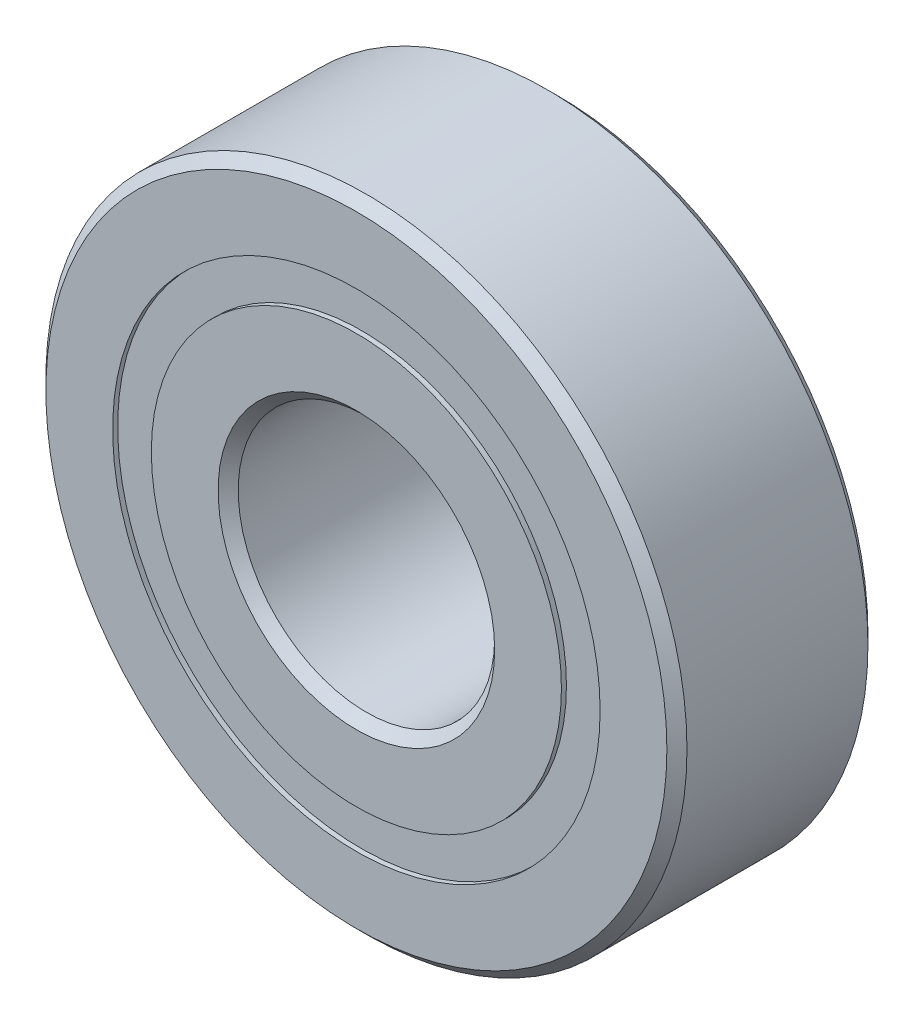
ISO-10303-21;
HEADER;
FILE_DESCRIPTION(('STEP AP214'),'2;1');
FILE_NAME('part.step','',(''),(''),'','','');
FILE_SCHEMA(('AUTOMOTIVE_DESIGN { 1 0 10303 214 1 1 1 1 }'));
ENDSEC;
DATA;
#1=APPLICATION_CONTEXT('core data for automotive mechanical design processes');
#2=APPLICATION_PROTOCOL_DEFINITION('international standard','automotive_design',2000,#1);
#3=PRODUCT_CONTEXT('',#1,'mechanical');
#4=PRODUCT('Part','Part','',(#3));
#5=PRODUCT_RELATED_PRODUCT_CATEGORY('part','',(#4));
#6=PRODUCT_DEFINITION_FORMATION('','',#4);
#7=PRODUCT_DEFINITION_CONTEXT('part definition',#1,'design');
#8=PRODUCT_DEFINITION('design','',#6,#7);
#9=PRODUCT_DEFINITION_SHAPE('','',#8);
#10=(LENGTH_UNIT() NAMED_UNIT(*) SI_UNIT(.MILLI.,.METRE.));
#11=(NAMED_UNIT(*) PLANE_ANGLE_UNIT() SI_UNIT($,.RADIAN.));
#12=(NAMED_UNIT(*) SI_UNIT($,.STERADIAN.) SOLID_ANGLE_UNIT());
#13=UNCERTAINTY_MEASURE_WITH_UNIT(LENGTH_MEASURE(1.E-05),#10,'distance_accuracy_value','');
#14=(GEOMETRIC_REPRESENTATION_CONTEXT(3) GLOBAL_UNCERTAINTY_ASSIGNED_CONTEXT((#13)) GLOBAL_UNIT_ASSIGNED_CONTEXT((#10,
#11,#12)) REPRESENTATION_CONTEXT('',''));
#15=CARTESIAN_POINT('',(0.,0.,0.));
#16=DIRECTION('',(0.,0.,1.));
#17=DIRECTION('',(1.,0.,0.));
#18=AXIS2_PLACEMENT_3D('',#15,#16,#17);
#19=CARTESIAN_POINT('',(0.,6.03522142857143,-2.36474));
#20=DIRECTION('',(0.,0.,1.));
#21=DIRECTION('',(1.,0.,0.));
#22=AXIS2_PLACEMENT_3D('',#19,#20,#21);
#23=PLANE('',#22);
#24=CARTESIAN_POINT('',(0.,0.,-2.36474));
#25=DIRECTION('',(0.,0.,1.));
#26=DIRECTION('',(1.,0.,0.));
#27=AXIS2_PLACEMENT_3D('',#24,#25,#26);
#28=CIRCLE('',#27,6.03522142857143);
#29=CARTESIAN_POINT('',(6.03522142857143,0.,-2.36474));
#30=VERTEX_POINT('',#29);
#31=EDGE_CURVE('E72',#30,#30,#28,.T.);
#32=ORIENTED_EDGE('',*,*,#31,.F.);
#33=EDGE_LOOP('',(#32));
#34=FACE_BOUND('',#33,.T.);
#35=CARTESIAN_POINT('',(0.,0.,-2.36474));
#36=DIRECTION('',(0.,0.,1.));
#37=DIRECTION('',(1.,0.,0.));
#38=AXIS2_PLACEMENT_3D('',#35,#36,#37);
#39=CIRCLE('',#38,5.07727857142857);
#40=CARTESIAN_POINT('',(5.07727857142857,0.,-2.36474));
#41=VERTEX_POINT('',#40);
#42=EDGE_CURVE('E11',#41,#41,#39,.T.);
#43=ORIENTED_EDGE('',*,*,#42,.T.);
#44=EDGE_LOOP('',(#43));
#45=FACE_BOUND('',#44,.T.);
#46=ADVANCED_FACE('F58',(#34,#45),#23,.F.);
#47=CARTESIAN_POINT('',(0.,0.,2.4892));
#48=DIRECTION('',(0.,0.,1.));
#49=DIRECTION('',(1.,0.,0.));
#50=AXIS2_PLACEMENT_3D('',#47,#48,#49);
#51=CYLINDRICAL_SURFACE('',#50,5.07727857142857);
#52=ORIENTED_EDGE('',*,*,#42,.F.);
#53=EDGE_LOOP('',(#52));
#54=FACE_BOUND('',#53,.T.);
#55=CARTESIAN_POINT('',(0.,0.,-1.20554465033679));
#56=DIRECTION('',(0.,0.,1.));
#57=DIRECTION('',(1.,0.,0.));
#58=AXIS2_PLACEMENT_3D('',#55,#56,#57);
#59=CIRCLE('',#58,5.07727857142857);
#60=CARTESIAN_POINT('',(5.07727857142857,0.,-1.20554465033679));
#61=VERTEX_POINT('',#60);
#62=EDGE_CURVE('E64',#61,#61,#59,.T.);
#63=ORIENTED_EDGE('',*,*,#62,.T.);
#64=EDGE_LOOP('',(#63));
#65=FACE_BOUND('',#64,.T.);
#66=ADVANCED_FACE('F81',(#54,#65),#51,.F.);
#67=CARTESIAN_POINT('',(0.,6.03522142857143,-1.20554465033679));
#68=DIRECTION('',(0.,0.,-1.));
#69=DIRECTION('',(-1.,0.,0.));
#70=AXIS2_PLACEMENT_3D('',#67,#68,#69);
#71=PLANE('',#70);
#72=ORIENTED_EDGE('',*,*,#62,.F.);
#73=EDGE_LOOP('',(#72));
#74=FACE_BOUND('',#73,.T.);
#75=CARTESIAN_POINT('',(0.,0.,-1.20554465033679));
#76=DIRECTION('',(0.,0.,1.));
#77=DIRECTION('',(1.,0.,0.));
#78=AXIS2_PLACEMENT_3D('',#75,#76,#77);
#79=CIRCLE('',#78,6.03522142857143);
#80=CARTESIAN_POINT('',(6.03522142857143,0.,-1.20554465033679));
#81=VERTEX_POINT('',#80);
#82=EDGE_CURVE('E68',#81,#81,#79,.T.);
#83=ORIENTED_EDGE('',*,*,#82,.T.);
#84=EDGE_LOOP('',(#83));
#85=FACE_BOUND('',#84,.T.);
#86=ADVANCED_FACE('F85',(#74,#85),#71,.F.);
#87=CARTESIAN_POINT('',(0.,0.,2.4892));
#88=DIRECTION('',(0.,0.,1.));
#89=DIRECTION('',(1.,0.,0.));
#90=AXIS2_PLACEMENT_3D('',#87,#88,#89);
#91=CYLINDRICAL_SURFACE('',#90,6.03522142857143);
#92=ORIENTED_EDGE('',*,*,#82,.F.);
#93=EDGE_LOOP('',(#92));
#94=FACE_BOUND('',#93,.T.);
#95=ORIENTED_EDGE('',*,*,#31,.T.);
#96=EDGE_LOOP('',(#95));
#97=FACE_BOUND('',#96,.T.);
#98=ADVANCED_FACE('F78',(#94,#97),#91,.T.);
#99=CLOSED_SHELL('',(#46,#66,#86,#98));
#100=MANIFOLD_SOLID_BREP('B2',#99);
#101=CARTESIAN_POINT('',(0.,6.03522142857143,2.36474));
#102=DIRECTION('',(0.,0.,-1.));
#103=DIRECTION('',(-1.,0.,0.));
#104=AXIS2_PLACEMENT_3D('',#101,#102,#103);
#105=PLANE('',#104);
#106=CARTESIAN_POINT('',(0.,0.,2.36474));
#107=DIRECTION('',(0.,0.,1.));
#108=DIRECTION('',(1.,0.,0.));
#109=AXIS2_PLACEMENT_3D('',#106,#107,#108);
#110=CIRCLE('',#109,5.07727857142857);
#111=CARTESIAN_POINT('',(5.07727857142857,0.,2.36474));
#112=VERTEX_POINT('',#111);
#113=EDGE_CURVE('E57',#112,#112,#110,.T.);
#114=ORIENTED_EDGE('',*,*,#113,.F.);
#115=EDGE_LOOP('',(#114));
#116=FACE_BOUND('',#115,.T.);
#117=CARTESIAN_POINT('',(0.,0.,2.36474));
#118=DIRECTION('',(0.,0.,1.));
#119=DIRECTION('',(1.,0.,0.));
#120=AXIS2_PLACEMENT_3D('',#117,#118,#119);
#121=CIRCLE('',#120,6.03522142857143);
#122=CARTESIAN_POINT('',(6.03522142857143,0.,2.36474));
#123=VERTEX_POINT('',#122);
#124=EDGE_CURVE('E156',#123,#123,#121,.T.);
#125=ORIENTED_EDGE('',*,*,#124,.T.);
#126=EDGE_LOOP('',(#125));
#127=FACE_BOUND('',#126,.T.);
#128=ADVANCED_FACE('F142',(#116,#127),#105,.F.);
#129=CARTESIAN_POINT('',(0.,0.,2.4892));
#130=DIRECTION('',(0.,0.,1.));
#131=DIRECTION('',(1.,0.,0.));
#132=AXIS2_PLACEMENT_3D('',#129,#130,#131);
#133=CYLINDRICAL_SURFACE('',#132,5.07727857142857);
#134=CARTESIAN_POINT('',(0.,0.,1.20554465033679));
#135=DIRECTION('',(0.,0.,1.));
#136=DIRECTION('',(1.,0.,0.));
#137=AXIS2_PLACEMENT_3D('',#134,#135,#136);
#138=CIRCLE('',#137,5.07727857142857);
#139=CARTESIAN_POINT('',(5.07727857142857,0.,1.20554465033679));
#140=VERTEX_POINT('',#139);
#141=EDGE_CURVE('E148',#140,#140,#138,.T.);
#142=ORIENTED_EDGE('',*,*,#141,.F.);
#143=EDGE_LOOP('',(#142));
#144=FACE_BOUND('',#143,.T.);
#145=ORIENTED_EDGE('',*,*,#113,.T.);
#146=EDGE_LOOP('',(#145));
#147=FACE_BOUND('',#146,.T.);
#148=ADVANCED_FACE('F171',(#144,#147),#133,.F.);
#149=CARTESIAN_POINT('',(0.,6.03522142857143,1.20554465033679));
#150=DIRECTION('',(0.,0.,1.));
#151=DIRECTION('',(1.,0.,0.));
#152=AXIS2_PLACEMENT_3D('',#149,#150,#151);
#153=PLANE('',#152);
#154=CARTESIAN_POINT('',(0.,0.,1.20554465033679));
#155=DIRECTION('',(0.,0.,1.));
#156=DIRECTION('',(1.,0.,0.));
#157=AXIS2_PLACEMENT_3D('',#154,#155,#156);
#158=CIRCLE('',#157,6.03522142857143);
#159=CARTESIAN_POINT('',(6.03522142857143,0.,1.20554465033679));
#160=VERTEX_POINT('',#159);
#161=EDGE_CURVE('E152',#160,#160,#158,.T.);
#162=ORIENTED_EDGE('',*,*,#161,.F.);
#163=EDGE_LOOP('',(#162));
#164=FACE_BOUND('',#163,.T.);
#165=ORIENTED_EDGE('',*,*,#141,.T.);
#166=EDGE_LOOP('',(#165));
#167=FACE_BOUND('',#166,.T.);
#168=ADVANCED_FACE('F166',(#164,#167),#153,.F.);
#169=CARTESIAN_POINT('',(0.,0.,2.4892));
#170=DIRECTION('',(0.,0.,1.));
#171=DIRECTION('',(1.,0.,0.));
#172=AXIS2_PLACEMENT_3D('',#169,#170,#171);
#173=CYLINDRICAL_SURFACE('',#172,6.03522142857143);
#174=ORIENTED_EDGE('',*,*,#124,.F.);
#175=EDGE_LOOP('',(#174));
#176=FACE_BOUND('',#175,.T.);
#177=ORIENTED_EDGE('',*,*,#161,.T.);
#178=EDGE_LOOP('',(#177));
#179=FACE_BOUND('',#178,.T.);
#180=ADVANCED_FACE('F163',(#176,#179),#173,.T.);
#181=CLOSED_SHELL('',(#128,#148,#168,#180));
#182=MANIFOLD_SOLID_BREP('B6',#181);
#183=CARTESIAN_POINT('',(-3.26588180805,4.49510067499584,0.));
#184=DIRECTION('',(0.,0.,1.));
#185=DIRECTION('',(-0.587785252292462,0.809016994374955,0.));
#186=AXIS2_PLACEMENT_3D('',#183,#184,#185);
#187=SPHERICAL_SURFACE('',#186,1.20554465033679);
#188=CARTESIAN_POINT('',(-3.26588180805,4.49510067499584,1.20554465033679));
#189=VERTEX_POINT('',#188);
#190=VERTEX_LOOP('',#189);
#191=FACE_BOUND('',#190,.T.);
#192=ADVANCED_FACE('F226',(#191),#187,.T.);
#193=CLOSED_SHELL('',(#192));
#194=MANIFOLD_SOLID_BREP('B52',#193);
#195=CARTESIAN_POINT('',(-5.28430776866493,1.71697567499586,0.));
#196=DIRECTION('',(0.,0.,1.));
#197=DIRECTION('',(-0.95105651629515,0.309016994374958,0.));
#198=AXIS2_PLACEMENT_3D('',#195,#196,#197);
#199=SPHERICAL_SURFACE('',#198,1.20554465033679);
#200=CARTESIAN_POINT('',(-5.28430776866493,1.71697567499586,1.20554465033679));
#201=VERTEX_POINT('',#200);
#202=VERTEX_LOOP('',#201);
#203=FACE_BOUND('',#202,.T.);
#204=ADVANCED_FACE('F249',(#203),#199,.T.);
#205=CLOSED_SHELL('',(#204));
#206=MANIFOLD_SOLID_BREP('B138',#205);
#207=CARTESIAN_POINT('',(-5.28430776866496,-1.71697567499575,0.));
#208=DIRECTION('',(0.,0.,1.));
#209=DIRECTION('',(-0.951056516295157,-0.309016994374938,0.));
#210=AXIS2_PLACEMENT_3D('',#207,#208,#209);
#211=SPHERICAL_SURFACE('',#210,1.20554465033679);
#212=CARTESIAN_POINT('',(-5.28430776866496,-1.71697567499575,1.20554465033679));
#213=VERTEX_POINT('',#212);
#214=VERTEX_LOOP('',#213);
#215=FACE_BOUND('',#214,.T.);
#216=ADVANCED_FACE('F272',(#215),#211,.T.);
#217=CLOSED_SHELL('',(#216));
#218=MANIFOLD_SOLID_BREP('B222',#217);
#219=CARTESIAN_POINT('',(-3.26588180805009,-4.49510067499577,0.));
#220=DIRECTION('',(0.,0.,1.));
#221=DIRECTION('',(-0.58778525229248,-0.809016994374942,0.));
#222=AXIS2_PLACEMENT_3D('',#219,#220,#221);
#223=SPHERICAL_SURFACE('',#222,1.20554465033679);
#224=CARTESIAN_POINT('',(-3.26588180805009,-4.49510067499577,1.20554465033679));
#225=VERTEX_POINT('',#224);
#226=VERTEX_LOOP('',#225);
#227=FACE_BOUND('',#226,.T.);
#228=ADVANCED_FACE('F295',(#227),#223,.T.);
#229=CLOSED_SHELL('',(#228));
#230=MANIFOLD_SOLID_BREP('B245',#229);
#231=CARTESIAN_POINT('',(0.,-5.55625,0.));
#232=DIRECTION('',(0.,0.,1.));
#233=DIRECTION('',(0.,-1.,0.));
#234=AXIS2_PLACEMENT_3D('',#231,#232,#233);
#235=SPHERICAL_SURFACE('',#234,1.20554465033679);
#236=CARTESIAN_POINT('',(0.,-5.55625,1.20554465033679));
#237=VERTEX_POINT('',#236);
#238=VERTEX_LOOP('',#237);
#239=FACE_BOUND('',#238,.T.);
#240=ADVANCED_FACE('F318',(#239),#235,.T.);
#241=CLOSED_SHELL('',(#240));
#242=MANIFOLD_SOLID_BREP('B268',#241);
#243=CARTESIAN_POINT('',(3.26588180805003,-4.49510067499582,0.));
#244=DIRECTION('',(0.,0.,1.));
#245=DIRECTION('',(0.587785252292469,-0.809016994374951,0.));
#246=AXIS2_PLACEMENT_3D('',#243,#244,#245);
#247=SPHERICAL_SURFACE('',#246,1.20554465033679);
#248=CARTESIAN_POINT('',(3.26588180805003,-4.49510067499582,1.20554465033679));
#249=VERTEX_POINT('',#248);
#250=VERTEX_LOOP('',#249);
#251=FACE_BOUND('',#250,.T.);
#252=ADVANCED_FACE('F341',(#251),#247,.T.);
#253=CLOSED_SHELL('',(#252));
#254=MANIFOLD_SOLID_BREP('B291',#253);
#255=CARTESIAN_POINT('',(5.28430776866494,-1.71697567499582,0.));
#256=DIRECTION('',(0.,0.,1.));
#257=DIRECTION('',(0.951056516295152,-0.309016994374952,0.));
#258=AXIS2_PLACEMENT_3D('',#255,#256,#257);
#259=SPHERICAL_SURFACE('',#258,1.20554465033679);
#260=CARTESIAN_POINT('',(5.28430776866494,-1.71697567499582,1.20554465033679));
#261=VERTEX_POINT('',#260);
#262=VERTEX_LOOP('',#261);
#263=FACE_BOUND('',#262,.T.);
#264=ADVANCED_FACE('F364',(#263),#259,.T.);
#265=CLOSED_SHELL('',(#264));
#266=MANIFOLD_SOLID_BREP('B314',#265);
#267=CARTESIAN_POINT('',(5.28430776866495,1.71697567499579,0.));
#268=DIRECTION('',(0.,0.,1.));
#269=DIRECTION('',(0.951056516295155,0.309016994374945,0.));
#270=AXIS2_PLACEMENT_3D('',#267,#268,#269);
#271=SPHERICAL_SURFACE('',#270,1.20554465033679);
#272=CARTESIAN_POINT('',(5.28430776866495,1.71697567499579,1.20554465033679));
#273=VERTEX_POINT('',#272);
#274=VERTEX_LOOP('',#273);
#275=FACE_BOUND('',#274,.T.);
#276=ADVANCED_FACE('F387',(#275),#271,.T.);
#277=CLOSED_SHELL('',(#276));
#278=MANIFOLD_SOLID_BREP('B337',#277);
#279=CARTESIAN_POINT('',(3.26588180805006,4.4951006749958,0.));
#280=DIRECTION('',(0.,0.,1.));
#281=DIRECTION('',(0.587785252292474,0.809016994374947,0.));
#282=AXIS2_PLACEMENT_3D('',#279,#280,#281);
#283=SPHERICAL_SURFACE('',#282,1.20554465033679);
#284=CARTESIAN_POINT('',(3.26588180805006,4.4951006749958,1.20554465033679));
#285=VERTEX_POINT('',#284);
#286=VERTEX_LOOP('',#285);
#287=FACE_BOUND('',#286,.T.);
#288=ADVANCED_FACE('F410',(#287),#283,.T.);
#289=CLOSED_SHELL('',(#288));
#290=MANIFOLD_SOLID_BREP('B360',#289);
#291=CARTESIAN_POINT('',(0.,5.55625,0.));
#292=DIRECTION('',(0.,0.,1.));
#293=DIRECTION('',(0.,1.,0.));
#294=AXIS2_PLACEMENT_3D('',#291,#292,#293);
#295=SPHERICAL_SURFACE('',#294,1.20554465033679);
#296=CARTESIAN_POINT('',(0.,5.55625,1.20554465033679));
#297=VERTEX_POINT('',#296);
#298=VERTEX_LOOP('',#297);
#299=FACE_BOUND('',#298,.T.);
#300=ADVANCED_FACE('F435',(#299),#295,.T.);
#301=CLOSED_SHELL('',(#300));
#302=MANIFOLD_SOLID_BREP('B383',#301);
#303=CARTESIAN_POINT('',(0.,5.07727857142857,2.4892));
#304=DIRECTION('',(0.,0.,-1.));
#305=DIRECTION('',(-1.,0.,0.));
#306=AXIS2_PLACEMENT_3D('',#303,#304,#305);
#307=PLANE('',#306);
#308=CARTESIAN_POINT('',(0.,0.,2.4892));
#309=DIRECTION('',(0.,0.,1.));
#310=DIRECTION('',(1.,0.,0.));
#311=AXIS2_PLACEMENT_3D('',#308,#309,#310);
#312=CIRCLE('',#311,3.42392);
#313=CARTESIAN_POINT('',(3.42392,0.,2.4892));
#314=VERTEX_POINT('',#313);
#315=EDGE_CURVE('E481',#314,#314,#312,.T.);
#316=ORIENTED_EDGE('',*,*,#315,.F.);
#317=EDGE_LOOP('',(#316));
#318=FACE_BOUND('',#317,.T.);
#319=CARTESIAN_POINT('',(0.,0.,2.4892));
#320=DIRECTION('',(0.,0.,1.));
#321=DIRECTION('',(1.,0.,0.));
#322=AXIS2_PLACEMENT_3D('',#319,#320,#321);
#323=CIRCLE('',#322,5.07727857142857);
#324=CARTESIAN_POINT('',(5.07727857142857,0.,2.4892));
#325=VERTEX_POINT('',#324);
#326=EDGE_CURVE('E434',#325,#325,#323,.T.);
#327=ORIENTED_EDGE('',*,*,#326,.T.);
#328=EDGE_LOOP('',(#327));
#329=FACE_BOUND('',#328,.T.);
#330=ADVANCED_FACE('F453',(#318,#329),#307,.F.);
#331=CARTESIAN_POINT('',(0.,0.,2.4892));
#332=DIRECTION('',(0.,0.,1.));
#333=DIRECTION('',(1.,0.,0.));
#334=AXIS2_PLACEMENT_3D('',#331,#332,#333);
#335=CYLINDRICAL_SURFACE('',#334,5.07727857142857);
#336=ORIENTED_EDGE('',*,*,#326,.F.);
#337=EDGE_LOOP('',(#336));
#338=FACE_BOUND('',#337,.T.);
#339=CARTESIAN_POINT('',(0.,0.,1.10631111111111));
#340=DIRECTION('',(0.,0.,1.));
#341=DIRECTION('',(1.,0.,0.));
#342=AXIS2_PLACEMENT_3D('',#339,#340,#341);
#343=CIRCLE('',#342,5.07727857142857);
#344=CARTESIAN_POINT('',(5.07727857142857,0.,1.10631111111111));
#345=VERTEX_POINT('',#344);
#346=EDGE_CURVE('E459',#345,#345,#343,.T.);
#347=ORIENTED_EDGE('',*,*,#346,.T.);
#348=EDGE_LOOP('',(#347));
#349=FACE_BOUND('',#348,.T.);
#350=ADVANCED_FACE('F488',(#338,#349),#335,.T.);
#351=CARTESIAN_POINT('',(0.,0.,0.));
#352=DIRECTION('',(0.,0.,1.));
#353=DIRECTION('',(1.,0.,0.));
#354=AXIS2_PLACEMENT_3D('',#351,#352,#353);
#355=TOROIDAL_SURFACE('',#354,5.55625,1.20554465033679);
#356=ORIENTED_EDGE('',*,*,#346,.F.);
#357=EDGE_LOOP('',(#356));
#358=FACE_BOUND('',#357,.T.);
#359=CARTESIAN_POINT('',(0.,0.,-1.10631111111111));
#360=DIRECTION('',(0.,0.,1.));
#361=DIRECTION('',(1.,0.,0.));
#362=AXIS2_PLACEMENT_3D('',#359,#360,#361);
#363=CIRCLE('',#362,5.07727857142857);
#364=CARTESIAN_POINT('',(5.07727857142857,0.,-1.10631111111111));
#365=VERTEX_POINT('',#364);
#366=EDGE_CURVE('E463',#365,#365,#363,.T.);
#367=ORIENTED_EDGE('',*,*,#366,.T.);
#368=EDGE_LOOP('',(#367));
#369=FACE_BOUND('',#368,.T.);
#370=ADVANCED_FACE('F492',(#358,#369),#355,.F.);
#371=CARTESIAN_POINT('',(0.,0.,2.4892));
#372=DIRECTION('',(0.,0.,1.));
#373=DIRECTION('',(1.,0.,0.));
#374=AXIS2_PLACEMENT_3D('',#371,#372,#373);
#375=CYLINDRICAL_SURFACE('',#374,5.07727857142857);
#376=ORIENTED_EDGE('',*,*,#366,.F.);
#377=EDGE_LOOP('',(#376));
#378=FACE_BOUND('',#377,.T.);
#379=CARTESIAN_POINT('',(0.,0.,-2.4892));
#380=DIRECTION('',(0.,0.,1.));
#381=DIRECTION('',(1.,0.,0.));
#382=AXIS2_PLACEMENT_3D('',#379,#380,#381);
#383=CIRCLE('',#382,5.07727857142857);
#384=CARTESIAN_POINT('',(5.07727857142857,0.,-2.4892));
#385=VERTEX_POINT('',#384);
#386=EDGE_CURVE('E467',#385,#385,#383,.T.);
#387=ORIENTED_EDGE('',*,*,#386,.T.);
#388=EDGE_LOOP('',(#387));
#389=FACE_BOUND('',#388,.T.);
#390=ADVANCED_FACE('F497',(#378,#389),#375,.T.);
#391=CARTESIAN_POINT('',(0.,3.42392,-2.4892));
#392=DIRECTION('',(0.,0.,1.));
#393=DIRECTION('',(1.,0.,0.));
#394=AXIS2_PLACEMENT_3D('',#391,#392,#393);
#395=PLANE('',#394);
#396=ORIENTED_EDGE('',*,*,#386,.F.);
#397=EDGE_LOOP('',(#396));
#398=FACE_BOUND('',#397,.T.);
#399=CARTESIAN_POINT('',(0.,0.,-2.4892));
#400=DIRECTION('',(0.,0.,1.));
#401=DIRECTION('',(1.,0.,0.));
#402=AXIS2_PLACEMENT_3D('',#399,#400,#401);
#403=CIRCLE('',#402,3.42392);
#404=CARTESIAN_POINT('',(3.42392,0.,-2.4892));
#405=VERTEX_POINT('',#404);
#406=EDGE_CURVE('E472',#405,#405,#403,.T.);
#407=ORIENTED_EDGE('',*,*,#406,.T.);
#408=EDGE_LOOP('',(#407));
#409=FACE_BOUND('',#408,.T.);
#410=ADVANCED_FACE('F503',(#398,#409),#395,.F.);
#411=CARTESIAN_POINT('',(0.,0.,-2.24028));
#412=DIRECTION('',(0.,0.,-1.));
#413=DIRECTION('',(-1.,0.,0.));
#414=AXIS2_PLACEMENT_3D('',#411,#412,#413);
#415=CONICAL_SURFACE('',#414,3.175,0.785398163397446);
#416=ORIENTED_EDGE('',*,*,#406,.F.);
#417=EDGE_LOOP('',(#416));
#418=FACE_BOUND('',#417,.T.);
#419=CARTESIAN_POINT('',(0.,0.,-2.24028));
#420=DIRECTION('',(0.,0.,1.));
#421=DIRECTION('',(1.,0.,0.));
#422=AXIS2_PLACEMENT_3D('',#419,#420,#421);
#423=CIRCLE('',#422,3.175);
#424=CARTESIAN_POINT('',(3.175,0.,-2.24028));
#425=VERTEX_POINT('',#424);
#426=EDGE_CURVE('E475',#425,#425,#423,.T.);
#427=ORIENTED_EDGE('',*,*,#426,.T.);
#428=EDGE_LOOP('',(#427));
#429=FACE_BOUND('',#428,.T.);
#430=ADVANCED_FACE('F507',(#418,#429),#415,.F.);
#431=CARTESIAN_POINT('',(0.,0.,2.4892));
#432=DIRECTION('',(0.,0.,1.));
#433=DIRECTION('',(1.,0.,0.));
#434=AXIS2_PLACEMENT_3D('',#431,#432,#433);
#435=CYLINDRICAL_SURFACE('',#434,3.175);
#436=ORIENTED_EDGE('',*,*,#426,.F.);
#437=EDGE_LOOP('',(#436));
#438=FACE_BOUND('',#437,.T.);
#439=CARTESIAN_POINT('',(0.,0.,2.24028));
#440=DIRECTION('',(0.,0.,1.));
#441=DIRECTION('',(1.,0.,0.));
#442=AXIS2_PLACEMENT_3D('',#439,#440,#441);
#443=CIRCLE('',#442,3.175);
#444=CARTESIAN_POINT('',(3.175,0.,2.24028));
#445=VERTEX_POINT('',#444);
#446=EDGE_CURVE('E478',#445,#445,#443,.T.);
#447=ORIENTED_EDGE('',*,*,#446,.T.);
#448=EDGE_LOOP('',(#447));
#449=FACE_BOUND('',#448,.T.);
#450=ADVANCED_FACE('F511',(#438,#449),#435,.F.);
#451=CARTESIAN_POINT('',(0.,0.,2.4892));
#452=DIRECTION('',(0.,0.,1.));
#453=DIRECTION('',(1.,0.,0.));
#454=AXIS2_PLACEMENT_3D('',#451,#452,#453);
#455=CONICAL_SURFACE('',#454,3.42392,0.785398163397449);
#456=ORIENTED_EDGE('',*,*,#446,.F.);
#457=EDGE_LOOP('',(#456));
#458=FACE_BOUND('',#457,.T.);
#459=ORIENTED_EDGE('',*,*,#315,.T.);
#460=EDGE_LOOP('',(#459));
#461=FACE_BOUND('',#460,.T.);
#462=ADVANCED_FACE('F485',(#458,#461),#455,.F.);
#463=CLOSED_SHELL('',(#330,#350,#370,#390,#410,#430,#450,#462));
#464=MANIFOLD_SOLID_BREP('B406',#463);
#465=CARTESIAN_POINT('',(0.,0.,2.24028));
#466=DIRECTION('',(0.,0.,-1.));
#467=DIRECTION('',(-1.,0.,0.));
#468=AXIS2_PLACEMENT_3D('',#465,#466,#467);
#469=CONICAL_SURFACE('',#468,7.9375,0.785398163397446);
#470=CARTESIAN_POINT('',(0.,0.,2.4892));
#471=DIRECTION('',(0.,0.,1.));
#472=DIRECTION('',(1.,0.,0.));
#473=AXIS2_PLACEMENT_3D('',#470,#471,#472);
#474=CIRCLE('',#473,7.68858);
#475=CARTESIAN_POINT('',(7.68858,0.,2.4892));
#476=VERTEX_POINT('',#475);
#477=EDGE_CURVE('E594',#476,#476,#474,.T.);
#478=ORIENTED_EDGE('',*,*,#477,.F.);
#479=EDGE_LOOP('',(#478));
#480=FACE_BOUND('',#479,.T.);
#481=CARTESIAN_POINT('',(0.,0.,2.24028));
#482=DIRECTION('',(0.,0.,1.));
#483=DIRECTION('',(1.,0.,0.));
#484=AXIS2_PLACEMENT_3D('',#481,#482,#483);
#485=CIRCLE('',#484,7.9375);
#486=CARTESIAN_POINT('',(7.9375,0.,2.24028));
#487=VERTEX_POINT('',#486);
#488=EDGE_CURVE('E452',#487,#487,#485,.T.);
#489=ORIENTED_EDGE('',*,*,#488,.T.);
#490=EDGE_LOOP('',(#489));
#491=FACE_BOUND('',#490,.T.);
#492=ADVANCED_FACE('F559',(#480,#491),#469,.T.);
#493=CARTESIAN_POINT('',(0.,0.,2.4892));
#494=DIRECTION('',(0.,0.,1.));
#495=DIRECTION('',(1.,0.,0.));
#496=AXIS2_PLACEMENT_3D('',#493,#494,#495);
#497=CYLINDRICAL_SURFACE('',#496,7.9375);
#498=ORIENTED_EDGE('',*,*,#488,.F.);
#499=EDGE_LOOP('',(#498));
#500=FACE_BOUND('',#499,.T.);
#501=CARTESIAN_POINT('',(0.,0.,-2.24028));
#502=DIRECTION('',(0.,0.,1.));
#503=DIRECTION('',(1.,0.,0.));
#504=AXIS2_PLACEMENT_3D('',#501,#502,#503);
#505=CIRCLE('',#504,7.9375);
#506=CARTESIAN_POINT('',(7.9375,0.,-2.24028));
#507=VERTEX_POINT('',#506);
#508=EDGE_CURVE('E566',#507,#507,#505,.T.);
#509=ORIENTED_EDGE('',*,*,#508,.T.);
#510=EDGE_LOOP('',(#509));
#511=FACE_BOUND('',#510,.T.);
#512=ADVANCED_FACE('F602',(#500,#511),#497,.T.);
#513=CARTESIAN_POINT('',(0.,0.,-2.4892));
#514=DIRECTION('',(0.,0.,1.));
#515=DIRECTION('',(1.,0.,0.));
#516=AXIS2_PLACEMENT_3D('',#513,#514,#515);
#517=CONICAL_SURFACE('',#516,7.68858,0.785398163397445);
#518=ORIENTED_EDGE('',*,*,#508,.F.);
#519=EDGE_LOOP('',(#518));
#520=FACE_BOUND('',#519,.T.);
#521=CARTESIAN_POINT('',(0.,0.,-2.4892));
#522=DIRECTION('',(0.,0.,1.));
#523=DIRECTION('',(1.,0.,0.));
#524=AXIS2_PLACEMENT_3D('',#521,#522,#523);
#525=CIRCLE('',#524,7.68858);
#526=CARTESIAN_POINT('',(7.68858,0.,-2.4892));
#527=VERTEX_POINT('',#526);
#528=EDGE_CURVE('E571',#527,#527,#525,.T.);
#529=ORIENTED_EDGE('',*,*,#528,.T.);
#530=EDGE_LOOP('',(#529));
#531=FACE_BOUND('',#530,.T.);
#532=ADVANCED_FACE('F606',(#520,#531),#517,.T.);
#533=CARTESIAN_POINT('',(0.,7.68858,-2.4892));
#534=DIRECTION('',(0.,0.,1.));
#535=DIRECTION('',(1.,0.,0.));
#536=AXIS2_PLACEMENT_3D('',#533,#534,#535);
#537=PLANE('',#536);
#538=ORIENTED_EDGE('',*,*,#528,.F.);
#539=EDGE_LOOP('',(#538));
#540=FACE_BOUND('',#539,.T.);
#541=CARTESIAN_POINT('',(0.,0.,-2.4892));
#542=DIRECTION('',(0.,0.,1.));
#543=DIRECTION('',(1.,0.,0.));
#544=AXIS2_PLACEMENT_3D('',#541,#542,#543);
#545=CIRCLE('',#544,6.03522142857143);
#546=CARTESIAN_POINT('',(6.03522142857143,0.,-2.4892));
#547=VERTEX_POINT('',#546);
#548=EDGE_CURVE('E576',#547,#547,#545,.T.);
#549=ORIENTED_EDGE('',*,*,#548,.T.);
#550=EDGE_LOOP('',(#549));
#551=FACE_BOUND('',#550,.T.);
#552=ADVANCED_FACE('F611',(#540,#551),#537,.F.);
#553=CARTESIAN_POINT('',(0.,0.,2.4892));
#554=DIRECTION('',(0.,0.,1.));
#555=DIRECTION('',(1.,0.,0.));
#556=AXIS2_PLACEMENT_3D('',#553,#554,#555);
#557=CYLINDRICAL_SURFACE('',#556,6.03522142857143);
#558=ORIENTED_EDGE('',*,*,#548,.F.);
#559=EDGE_LOOP('',(#558));
#560=FACE_BOUND('',#559,.T.);
#561=CARTESIAN_POINT('',(0.,0.,-1.10631111111111));
#562=DIRECTION('',(0.,0.,1.));
#563=DIRECTION('',(1.,0.,0.));
#564=AXIS2_PLACEMENT_3D('',#561,#562,#563);
#565=CIRCLE('',#564,6.03522142857143);
#566=CARTESIAN_POINT('',(6.03522142857143,0.,-1.10631111111111));
#567=VERTEX_POINT('',#566);
#568=EDGE_CURVE('E582',#567,#567,#565,.T.);
#569=ORIENTED_EDGE('',*,*,#568,.T.);
#570=EDGE_LOOP('',(#569));
#571=FACE_BOUND('',#570,.T.);
#572=ADVANCED_FACE('F617',(#560,#571),#557,.F.);
#573=CARTESIAN_POINT('',(0.,0.,0.));
#574=DIRECTION('',(0.,0.,1.));
#575=DIRECTION('',(1.,0.,0.));
#576=AXIS2_PLACEMENT_3D('',#573,#574,#575);
#577=TOROIDAL_SURFACE('',#576,5.55625,1.20554465033679);
#578=ORIENTED_EDGE('',*,*,#568,.F.);
#579=EDGE_LOOP('',(#578));
#580=FACE_BOUND('',#579,.T.);
#581=CARTESIAN_POINT('',(0.,0.,1.10631111111111));
#582=DIRECTION('',(0.,0.,1.));
#583=DIRECTION('',(1.,0.,0.));
#584=AXIS2_PLACEMENT_3D('',#581,#582,#583);
#585=CIRCLE('',#584,6.03522142857143);
#586=CARTESIAN_POINT('',(6.03522142857143,0.,1.10631111111111));
#587=VERTEX_POINT('',#586);
#588=EDGE_CURVE('E586',#587,#587,#585,.T.);
#589=ORIENTED_EDGE('',*,*,#588,.T.);
#590=EDGE_LOOP('',(#589));
#591=FACE_BOUND('',#590,.T.);
#592=ADVANCED_FACE('F621',(#580,#591),#577,.F.);
#593=CARTESIAN_POINT('',(0.,0.,2.4892));
#594=DIRECTION('',(0.,0.,1.));
#595=DIRECTION('',(1.,0.,0.));
#596=AXIS2_PLACEMENT_3D('',#593,#594,#595);
#597=CYLINDRICAL_SURFACE('',#596,6.03522142857143);
#598=ORIENTED_EDGE('',*,*,#588,.F.);
#599=EDGE_LOOP('',(#598));
#600=FACE_BOUND('',#599,.T.);
#601=CARTESIAN_POINT('',(0.,0.,2.4892));
#602=DIRECTION('',(0.,0.,1.));
#603=DIRECTION('',(1.,0.,0.));
#604=AXIS2_PLACEMENT_3D('',#601,#602,#603);
#605=CIRCLE('',#604,6.03522142857143);
#606=CARTESIAN_POINT('',(6.03522142857143,0.,2.4892));
#607=VERTEX_POINT('',#606);
#608=EDGE_CURVE('E590',#607,#607,#605,.T.);
#609=ORIENTED_EDGE('',*,*,#608,.T.);
#610=EDGE_LOOP('',(#609));
#611=FACE_BOUND('',#610,.T.);
#612=ADVANCED_FACE('F625',(#600,#611),#597,.F.);
#613=CARTESIAN_POINT('',(0.,7.68858,2.4892));
#614=DIRECTION('',(0.,0.,-1.));
#615=DIRECTION('',(-1.,0.,0.));
#616=AXIS2_PLACEMENT_3D('',#613,#614,#615);
#617=PLANE('',#616);
#618=ORIENTED_EDGE('',*,*,#608,.F.);
#619=EDGE_LOOP('',(#618));
#620=FACE_BOUND('',#619,.T.);
#621=ORIENTED_EDGE('',*,*,#477,.T.);
#622=EDGE_LOOP('',(#621));
#623=FACE_BOUND('',#622,.T.);
#624=ADVANCED_FACE('F599',(#620,#623),#617,.F.);
#625=CLOSED_SHELL('',(#492,#512,#532,#552,#572,#592,#612,#624));
#626=MANIFOLD_SOLID_BREP('B429',#625);
#627=ADVANCED_BREP_SHAPE_REPRESENTATION('',(#18,#100,#182,#194,#206,#218,#230,#242,#254,#266,
#278,#290,#302,#464,#626),#14);
#628=SHAPE_DEFINITION_REPRESENTATION(#9,#627);
ENDSEC;
END-ISO-10303-21;
